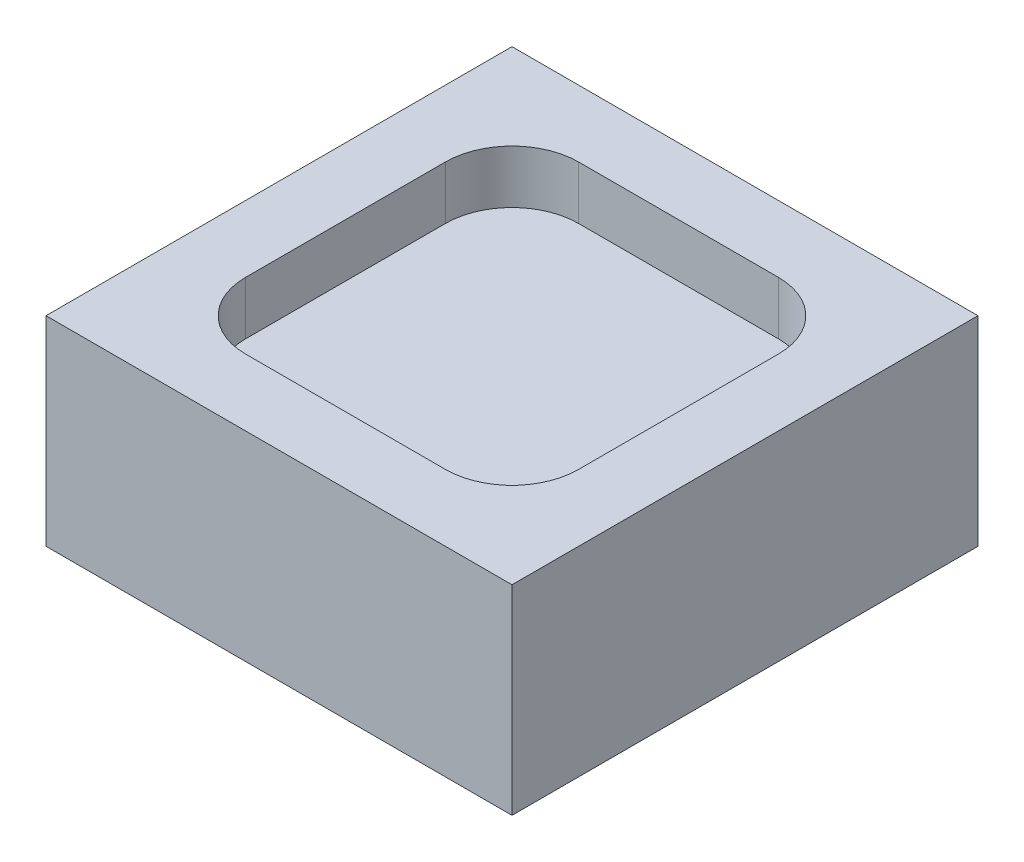
ISO-10303-21;
HEADER;
FILE_DESCRIPTION(('STEP AP214'),'2;1');
FILE_NAME('part.step','',(''),(''),'','','');
FILE_SCHEMA(('AUTOMOTIVE_DESIGN { 1 0 10303 214 1 1 1 1 }'));
ENDSEC;
DATA;
#1=APPLICATION_CONTEXT('core data for automotive mechanical design processes');
#2=APPLICATION_PROTOCOL_DEFINITION('international standard','automotive_design',2000,#1);
#3=PRODUCT_CONTEXT('',#1,'mechanical');
#4=PRODUCT('Part','Part','',(#3));
#5=PRODUCT_RELATED_PRODUCT_CATEGORY('part','',(#4));
#6=PRODUCT_DEFINITION_FORMATION('','',#4);
#7=PRODUCT_DEFINITION_CONTEXT('part definition',#1,'design');
#8=PRODUCT_DEFINITION('design','',#6,#7);
#9=PRODUCT_DEFINITION_SHAPE('','',#8);
#10=(LENGTH_UNIT() NAMED_UNIT(*) SI_UNIT(.MILLI.,.METRE.));
#11=(NAMED_UNIT(*) PLANE_ANGLE_UNIT() SI_UNIT($,.RADIAN.));
#12=(NAMED_UNIT(*) SI_UNIT($,.STERADIAN.) SOLID_ANGLE_UNIT());
#13=UNCERTAINTY_MEASURE_WITH_UNIT(LENGTH_MEASURE(1.E-05),#10,'distance_accuracy_value','');
#14=(GEOMETRIC_REPRESENTATION_CONTEXT(3) GLOBAL_UNCERTAINTY_ASSIGNED_CONTEXT((#13)) GLOBAL_UNIT_ASSIGNED_CONTEXT((#10,
#11,#12)) REPRESENTATION_CONTEXT('',''));
#15=CARTESIAN_POINT('',(0.,0.,0.));
#16=DIRECTION('',(0.,0.,1.));
#17=DIRECTION('',(1.,0.,0.));
#18=AXIS2_PLACEMENT_3D('',#15,#16,#17);
#19=CARTESIAN_POINT('',(3.5,3.,-3.5));
#20=DIRECTION('',(-1.,0.,0.));
#21=DIRECTION('',(0.,0.,1.));
#22=AXIS2_PLACEMENT_3D('',#19,#20,#21);
#23=PLANE('',#22);
#24=DIRECTION('',(0.,0.,-1.));
#25=VECTOR('',#24,1.);
#26=CARTESIAN_POINT('',(3.5,0.,-3.5));
#27=LINE('',#26,#25);
#28=CARTESIAN_POINT('',(3.5,0.,3.5));
#29=VERTEX_POINT('',#28);
#30=CARTESIAN_POINT('',(3.5,0.,-3.5));
#31=VERTEX_POINT('',#30);
#32=EDGE_CURVE('E198',#29,#31,#27,.T.);
#33=ORIENTED_EDGE('',*,*,#32,.T.);
#34=DIRECTION('',(0.,-1.,0.));
#35=VECTOR('',#34,1.);
#36=CARTESIAN_POINT('',(3.5,3.,-3.5));
#37=LINE('',#36,#35);
#38=CARTESIAN_POINT('',(3.5,3.,-3.5));
#39=VERTEX_POINT('',#38);
#40=EDGE_CURVE('E12',#39,#31,#37,.T.);
#41=ORIENTED_EDGE('',*,*,#40,.F.);
#42=DIRECTION('',(0.,0.,-1.));
#43=VECTOR('',#42,1.);
#44=CARTESIAN_POINT('',(3.5,3.,-3.5));
#45=LINE('',#44,#43);
#46=CARTESIAN_POINT('',(3.5,3.,3.5));
#47=VERTEX_POINT('',#46);
#48=EDGE_CURVE('E210',#47,#39,#45,.T.);
#49=ORIENTED_EDGE('',*,*,#48,.F.);
#50=DIRECTION('',(0.,-1.,0.));
#51=VECTOR('',#50,1.);
#52=CARTESIAN_POINT('',(3.5,3.,3.5));
#53=LINE('',#52,#51);
#54=EDGE_CURVE('E216',#47,#29,#53,.T.);
#55=ORIENTED_EDGE('',*,*,#54,.T.);
#56=EDGE_LOOP('',(#33,#41,#49,#55));
#57=FACE_BOUND('',#56,.T.);
#58=ADVANCED_FACE('F41',(#57),#23,.F.);
#59=CARTESIAN_POINT('',(-3.5,3.,-3.5));
#60=DIRECTION('',(0.,0.,1.));
#61=DIRECTION('',(1.,0.,0.));
#62=AXIS2_PLACEMENT_3D('',#59,#60,#61);
#63=PLANE('',#62);
#64=DIRECTION('',(-1.,0.,0.));
#65=VECTOR('',#64,1.);
#66=CARTESIAN_POINT('',(-3.5,0.,-3.5));
#67=LINE('',#66,#65);
#68=CARTESIAN_POINT('',(-3.5,0.,-3.5));
#69=VERTEX_POINT('',#68);
#70=EDGE_CURVE('E219',#31,#69,#67,.T.);
#71=ORIENTED_EDGE('',*,*,#70,.T.);
#72=DIRECTION('',(0.,-1.,0.));
#73=VECTOR('',#72,1.);
#74=CARTESIAN_POINT('',(-3.5,3.,-3.5));
#75=LINE('',#74,#73);
#76=CARTESIAN_POINT('',(-3.5,3.,-3.5));
#77=VERTEX_POINT('',#76);
#78=EDGE_CURVE('E48',#77,#69,#75,.T.);
#79=ORIENTED_EDGE('',*,*,#78,.F.);
#80=DIRECTION('',(-1.,0.,0.));
#81=VECTOR('',#80,1.);
#82=CARTESIAN_POINT('',(-3.5,3.,-3.5));
#83=LINE('',#82,#81);
#84=EDGE_CURVE('E92',#39,#77,#83,.T.);
#85=ORIENTED_EDGE('',*,*,#84,.F.);
#86=ORIENTED_EDGE('',*,*,#40,.T.);
#87=EDGE_LOOP('',(#71,#79,#85,#86));
#88=FACE_BOUND('',#87,.T.);
#89=ADVANCED_FACE('F248',(#88),#63,.F.);
#90=CARTESIAN_POINT('',(-3.5,3.,-3.5));
#91=DIRECTION('',(1.,0.,0.));
#92=DIRECTION('',(0.,0.,-1.));
#93=AXIS2_PLACEMENT_3D('',#90,#91,#92);
#94=PLANE('',#93);
#95=DIRECTION('',(0.,0.,1.));
#96=VECTOR('',#95,1.);
#97=CARTESIAN_POINT('',(-3.5,0.,-3.5));
#98=LINE('',#97,#96);
#99=CARTESIAN_POINT('',(-3.5,0.,3.5));
#100=VERTEX_POINT('',#99);
#101=EDGE_CURVE('E221',#69,#100,#98,.T.);
#102=ORIENTED_EDGE('',*,*,#101,.T.);
#103=DIRECTION('',(0.,-1.,0.));
#104=VECTOR('',#103,1.);
#105=CARTESIAN_POINT('',(-3.5,3.,3.5));
#106=LINE('',#105,#104);
#107=CARTESIAN_POINT('',(-3.5,3.,3.5));
#108=VERTEX_POINT('',#107);
#109=EDGE_CURVE('E225',#108,#100,#106,.T.);
#110=ORIENTED_EDGE('',*,*,#109,.F.);
#111=DIRECTION('',(0.,0.,1.));
#112=VECTOR('',#111,1.);
#113=CARTESIAN_POINT('',(-3.5,3.,-3.5));
#114=LINE('',#113,#112);
#115=EDGE_CURVE('E213',#77,#108,#114,.T.);
#116=ORIENTED_EDGE('',*,*,#115,.F.);
#117=ORIENTED_EDGE('',*,*,#78,.T.);
#118=EDGE_LOOP('',(#102,#110,#116,#117));
#119=FACE_BOUND('',#118,.T.);
#120=ADVANCED_FACE('F230',(#119),#94,.F.);
#121=CARTESIAN_POINT('',(-3.5,3.,3.5));
#122=DIRECTION('',(0.,0.,-1.));
#123=DIRECTION('',(-1.,0.,0.));
#124=AXIS2_PLACEMENT_3D('',#121,#122,#123);
#125=PLANE('',#124);
#126=DIRECTION('',(1.,0.,0.));
#127=VECTOR('',#126,1.);
#128=CARTESIAN_POINT('',(-3.5,0.,3.5));
#129=LINE('',#128,#127);
#130=EDGE_CURVE('E85',#100,#29,#129,.T.);
#131=ORIENTED_EDGE('',*,*,#130,.T.);
#132=ORIENTED_EDGE('',*,*,#54,.F.);
#133=DIRECTION('',(1.,0.,0.));
#134=VECTOR('',#133,1.);
#135=CARTESIAN_POINT('',(-3.5,3.,3.5));
#136=LINE('',#135,#134);
#137=EDGE_CURVE('E64',#108,#47,#136,.T.);
#138=ORIENTED_EDGE('',*,*,#137,.F.);
#139=ORIENTED_EDGE('',*,*,#109,.T.);
#140=EDGE_LOOP('',(#131,#132,#138,#139));
#141=FACE_BOUND('',#140,.T.);
#142=ADVANCED_FACE('F238',(#141),#125,.F.);
#143=CARTESIAN_POINT('',(0.,3.,0.));
#144=DIRECTION('',(0.,1.,0.));
#145=DIRECTION('',(0.,0.,1.));
#146=AXIS2_PLACEMENT_3D('',#143,#144,#145);
#147=PLANE('',#146);
#148=CARTESIAN_POINT('',(-1.5,3.,1.5));
#149=DIRECTION('',(0.,1.,0.));
#150=DIRECTION('',(0.,0.,1.));
#151=AXIS2_PLACEMENT_3D('',#148,#149,#150);
#152=CIRCLE('',#151,1.);
#153=CARTESIAN_POINT('',(-2.5,3.,1.5));
#154=VERTEX_POINT('',#153);
#155=CARTESIAN_POINT('',(-1.5,3.,2.5));
#156=VERTEX_POINT('',#155);
#157=EDGE_CURVE('E55',#154,#156,#152,.T.);
#158=ORIENTED_EDGE('',*,*,#157,.F.);
#159=DIRECTION('',(0.,0.,1.));
#160=VECTOR('',#159,1.);
#161=CARTESIAN_POINT('',(-2.5,3.,-1.5));
#162=LINE('',#161,#160);
#163=CARTESIAN_POINT('',(-2.5,3.,-1.5));
#164=VERTEX_POINT('',#163);
#165=EDGE_CURVE('E159',#164,#154,#162,.T.);
#166=ORIENTED_EDGE('',*,*,#165,.F.);
#167=CARTESIAN_POINT('',(-1.5,3.,-1.5));
#168=DIRECTION('',(0.,1.,0.));
#169=DIRECTION('',(0.,0.,1.));
#170=AXIS2_PLACEMENT_3D('',#167,#168,#169);
#171=CIRCLE('',#170,1.);
#172=CARTESIAN_POINT('',(-1.5,3.,-2.5));
#173=VERTEX_POINT('',#172);
#174=EDGE_CURVE('E162',#173,#164,#171,.T.);
#175=ORIENTED_EDGE('',*,*,#174,.F.);
#176=DIRECTION('',(-1.,0.,0.));
#177=VECTOR('',#176,1.);
#178=CARTESIAN_POINT('',(-1.5,3.,-2.5));
#179=LINE('',#178,#177);
#180=CARTESIAN_POINT('',(1.5,3.,-2.5));
#181=VERTEX_POINT('',#180);
#182=EDGE_CURVE('E191',#181,#173,#179,.T.);
#183=ORIENTED_EDGE('',*,*,#182,.F.);
#184=CARTESIAN_POINT('',(1.5,3.,-1.5));
#185=DIRECTION('',(0.,1.,0.));
#186=DIRECTION('',(0.,0.,-1.));
#187=AXIS2_PLACEMENT_3D('',#184,#185,#186);
#188=CIRCLE('',#187,1.);
#189=CARTESIAN_POINT('',(2.5,3.,-1.5));
#190=VERTEX_POINT('',#189);
#191=EDGE_CURVE('E188',#190,#181,#188,.T.);
#192=ORIENTED_EDGE('',*,*,#191,.F.);
#193=DIRECTION('',(0.,0.,-1.));
#194=VECTOR('',#193,1.);
#195=CARTESIAN_POINT('',(2.5,3.,-1.5));
#196=LINE('',#195,#194);
#197=CARTESIAN_POINT('',(2.5,3.,1.5));
#198=VERTEX_POINT('',#197);
#199=EDGE_CURVE('E185',#198,#190,#196,.T.);
#200=ORIENTED_EDGE('',*,*,#199,.F.);
#201=CARTESIAN_POINT('',(1.5,3.,1.5));
#202=DIRECTION('',(0.,1.,0.));
#203=DIRECTION('',(0.,0.,1.));
#204=AXIS2_PLACEMENT_3D('',#201,#202,#203);
#205=CIRCLE('',#204,1.);
#206=CARTESIAN_POINT('',(1.5,3.,2.5));
#207=VERTEX_POINT('',#206);
#208=EDGE_CURVE('E182',#207,#198,#205,.T.);
#209=ORIENTED_EDGE('',*,*,#208,.F.);
#210=DIRECTION('',(1.,0.,0.));
#211=VECTOR('',#210,1.);
#212=CARTESIAN_POINT('',(-1.5,3.,2.5));
#213=LINE('',#212,#211);
#214=EDGE_CURVE('E180',#156,#207,#213,.T.);
#215=ORIENTED_EDGE('',*,*,#214,.F.);
#216=EDGE_LOOP('',(#158,#166,#175,#183,#192,#200,#209,#215));
#217=FACE_BOUND('',#216,.T.);
#218=ORIENTED_EDGE('',*,*,#48,.T.);
#219=ORIENTED_EDGE('',*,*,#84,.T.);
#220=ORIENTED_EDGE('',*,*,#115,.T.);
#221=ORIENTED_EDGE('',*,*,#137,.T.);
#222=EDGE_LOOP('',(#218,#219,#220,#221));
#223=FACE_BOUND('',#222,.T.);
#224=ADVANCED_FACE('F240',(#217,#223),#147,.T.);
#225=CARTESIAN_POINT('',(0.,0.,0.));
#226=DIRECTION('',(0.,1.,0.));
#227=DIRECTION('',(0.,0.,1.));
#228=AXIS2_PLACEMENT_3D('',#225,#226,#227);
#229=PLANE('',#228);
#230=ORIENTED_EDGE('',*,*,#32,.F.);
#231=ORIENTED_EDGE('',*,*,#130,.F.);
#232=ORIENTED_EDGE('',*,*,#101,.F.);
#233=ORIENTED_EDGE('',*,*,#70,.F.);
#234=EDGE_LOOP('',(#230,#231,#232,#233));
#235=FACE_BOUND('',#234,.T.);
#236=ADVANCED_FACE('F234',(#235),#229,.F.);
#237=CARTESIAN_POINT('',(-1.5,2.2,1.5));
#238=DIRECTION('',(0.,1.,0.));
#239=DIRECTION('',(0.,0.,1.));
#240=AXIS2_PLACEMENT_3D('',#237,#238,#239);
#241=CYLINDRICAL_SURFACE('',#240,1.);
#242=ORIENTED_EDGE('',*,*,#157,.T.);
#243=DIRECTION('',(0.,1.,0.));
#244=VECTOR('',#243,1.);
#245=CARTESIAN_POINT('',(-1.5,2.2,2.5));
#246=LINE('',#245,#244);
#247=CARTESIAN_POINT('',(-1.5,2.2,2.5));
#248=VERTEX_POINT('',#247);
#249=EDGE_CURVE('E136',#248,#156,#246,.T.);
#250=ORIENTED_EDGE('',*,*,#249,.F.);
#251=CARTESIAN_POINT('',(-1.5,2.2,1.5));
#252=DIRECTION('',(0.,1.,0.));
#253=DIRECTION('',(0.,0.,1.));
#254=AXIS2_PLACEMENT_3D('',#251,#252,#253);
#255=CIRCLE('',#254,1.);
#256=CARTESIAN_POINT('',(-2.5,2.2,1.5));
#257=VERTEX_POINT('',#256);
#258=EDGE_CURVE('E140',#257,#248,#255,.T.);
#259=ORIENTED_EDGE('',*,*,#258,.F.);
#260=DIRECTION('',(0.,1.,0.));
#261=VECTOR('',#260,1.);
#262=CARTESIAN_POINT('',(-2.5,2.2,1.5));
#263=LINE('',#262,#261);
#264=EDGE_CURVE('E196',#257,#154,#263,.T.);
#265=ORIENTED_EDGE('',*,*,#264,.T.);
#266=EDGE_LOOP('',(#242,#250,#259,#265));
#267=FACE_BOUND('',#266,.T.);
#268=ADVANCED_FACE('F138',(#267),#241,.F.);
#269=CARTESIAN_POINT('',(-2.5,2.2,-1.5));
#270=DIRECTION('',(-1.,0.,0.));
#271=DIRECTION('',(0.,0.,1.));
#272=AXIS2_PLACEMENT_3D('',#269,#270,#271);
#273=PLANE('',#272);
#274=ORIENTED_EDGE('',*,*,#165,.T.);
#275=ORIENTED_EDGE('',*,*,#264,.F.);
#276=DIRECTION('',(0.,0.,1.));
#277=VECTOR('',#276,1.);
#278=CARTESIAN_POINT('',(-2.5,2.2,-1.5));
#279=LINE('',#278,#277);
#280=CARTESIAN_POINT('',(-2.5,2.2,-1.5));
#281=VERTEX_POINT('',#280);
#282=EDGE_CURVE('E146',#281,#257,#279,.T.);
#283=ORIENTED_EDGE('',*,*,#282,.F.);
#284=DIRECTION('',(0.,1.,0.));
#285=VECTOR('',#284,1.);
#286=CARTESIAN_POINT('',(-2.5,2.2,-1.5));
#287=LINE('',#286,#285);
#288=EDGE_CURVE('E199',#281,#164,#287,.T.);
#289=ORIENTED_EDGE('',*,*,#288,.T.);
#290=EDGE_LOOP('',(#274,#275,#283,#289));
#291=FACE_BOUND('',#290,.T.);
#292=ADVANCED_FACE('F287',(#291),#273,.F.);
#293=CARTESIAN_POINT('',(-1.5,2.2,-1.5));
#294=DIRECTION('',(0.,1.,0.));
#295=DIRECTION('',(0.,0.,1.));
#296=AXIS2_PLACEMENT_3D('',#293,#294,#295);
#297=CYLINDRICAL_SURFACE('',#296,1.);
#298=ORIENTED_EDGE('',*,*,#174,.T.);
#299=ORIENTED_EDGE('',*,*,#288,.F.);
#300=CARTESIAN_POINT('',(-1.5,2.2,-1.5));
#301=DIRECTION('',(0.,1.,0.));
#302=DIRECTION('',(0.,0.,1.));
#303=AXIS2_PLACEMENT_3D('',#300,#301,#302);
#304=CIRCLE('',#303,1.);
#305=CARTESIAN_POINT('',(-1.5,2.2,-2.5));
#306=VERTEX_POINT('',#305);
#307=EDGE_CURVE('E174',#306,#281,#304,.T.);
#308=ORIENTED_EDGE('',*,*,#307,.F.);
#309=DIRECTION('',(0.,1.,0.));
#310=VECTOR('',#309,1.);
#311=CARTESIAN_POINT('',(-1.5,2.2,-2.5));
#312=LINE('',#311,#310);
#313=EDGE_CURVE('E201',#306,#173,#312,.T.);
#314=ORIENTED_EDGE('',*,*,#313,.T.);
#315=EDGE_LOOP('',(#298,#299,#308,#314));
#316=FACE_BOUND('',#315,.T.);
#317=ADVANCED_FACE('F296',(#316),#297,.F.);
#318=CARTESIAN_POINT('',(-1.5,2.2,-2.5));
#319=DIRECTION('',(0.,0.,-1.));
#320=DIRECTION('',(-1.,0.,0.));
#321=AXIS2_PLACEMENT_3D('',#318,#319,#320);
#322=PLANE('',#321);
#323=ORIENTED_EDGE('',*,*,#182,.T.);
#324=ORIENTED_EDGE('',*,*,#313,.F.);
#325=DIRECTION('',(-1.,0.,0.));
#326=VECTOR('',#325,1.);
#327=CARTESIAN_POINT('',(-1.5,2.2,-2.5));
#328=LINE('',#327,#326);
#329=CARTESIAN_POINT('',(1.5,2.2,-2.5));
#330=VERTEX_POINT('',#329);
#331=EDGE_CURVE('E172',#330,#306,#328,.T.);
#332=ORIENTED_EDGE('',*,*,#331,.F.);
#333=DIRECTION('',(0.,1.,0.));
#334=VECTOR('',#333,1.);
#335=CARTESIAN_POINT('',(1.5,2.2,-2.5));
#336=LINE('',#335,#334);
#337=EDGE_CURVE('E203',#330,#181,#336,.T.);
#338=ORIENTED_EDGE('',*,*,#337,.T.);
#339=EDGE_LOOP('',(#323,#324,#332,#338));
#340=FACE_BOUND('',#339,.T.);
#341=ADVANCED_FACE('F306',(#340),#322,.F.);
#342=CARTESIAN_POINT('',(1.5,2.2,-1.5));
#343=DIRECTION('',(0.,1.,0.));
#344=DIRECTION('',(0.,0.,1.));
#345=AXIS2_PLACEMENT_3D('',#342,#343,#344);
#346=CYLINDRICAL_SURFACE('',#345,1.);
#347=ORIENTED_EDGE('',*,*,#191,.T.);
#348=ORIENTED_EDGE('',*,*,#337,.F.);
#349=CARTESIAN_POINT('',(1.5,2.2,-1.5));
#350=DIRECTION('',(0.,1.,0.));
#351=DIRECTION('',(0.,0.,-1.));
#352=AXIS2_PLACEMENT_3D('',#349,#350,#351);
#353=CIRCLE('',#352,1.);
#354=CARTESIAN_POINT('',(2.5,2.2,-1.5));
#355=VERTEX_POINT('',#354);
#356=EDGE_CURVE('E169',#355,#330,#353,.T.);
#357=ORIENTED_EDGE('',*,*,#356,.F.);
#358=DIRECTION('',(0.,1.,0.));
#359=VECTOR('',#358,1.);
#360=CARTESIAN_POINT('',(2.5,2.2,-1.5));
#361=LINE('',#360,#359);
#362=EDGE_CURVE('E205',#355,#190,#361,.T.);
#363=ORIENTED_EDGE('',*,*,#362,.T.);
#364=EDGE_LOOP('',(#347,#348,#357,#363));
#365=FACE_BOUND('',#364,.T.);
#366=ADVANCED_FACE('F316',(#365),#346,.F.);
#367=CARTESIAN_POINT('',(2.5,2.2,-1.5));
#368=DIRECTION('',(1.,0.,0.));
#369=DIRECTION('',(0.,0.,-1.));
#370=AXIS2_PLACEMENT_3D('',#367,#368,#369);
#371=PLANE('',#370);
#372=ORIENTED_EDGE('',*,*,#199,.T.);
#373=ORIENTED_EDGE('',*,*,#362,.F.);
#374=DIRECTION('',(0.,0.,-1.));
#375=VECTOR('',#374,1.);
#376=CARTESIAN_POINT('',(2.5,2.2,-1.5));
#377=LINE('',#376,#375);
#378=CARTESIAN_POINT('',(2.5,2.2,1.5));
#379=VERTEX_POINT('',#378);
#380=EDGE_CURVE('E166',#379,#355,#377,.T.);
#381=ORIENTED_EDGE('',*,*,#380,.F.);
#382=DIRECTION('',(0.,1.,0.));
#383=VECTOR('',#382,1.);
#384=CARTESIAN_POINT('',(2.5,2.2,1.5));
#385=LINE('',#384,#383);
#386=EDGE_CURVE('E207',#379,#198,#385,.T.);
#387=ORIENTED_EDGE('',*,*,#386,.T.);
#388=EDGE_LOOP('',(#372,#373,#381,#387));
#389=FACE_BOUND('',#388,.T.);
#390=ADVANCED_FACE('F326',(#389),#371,.F.);
#391=CARTESIAN_POINT('',(1.5,2.2,1.5));
#392=DIRECTION('',(0.,1.,0.));
#393=DIRECTION('',(0.,0.,1.));
#394=AXIS2_PLACEMENT_3D('',#391,#392,#393);
#395=CYLINDRICAL_SURFACE('',#394,1.);
#396=ORIENTED_EDGE('',*,*,#208,.T.);
#397=ORIENTED_EDGE('',*,*,#386,.F.);
#398=CARTESIAN_POINT('',(1.5,2.2,1.5));
#399=DIRECTION('',(0.,1.,0.));
#400=DIRECTION('',(0.,0.,1.));
#401=AXIS2_PLACEMENT_3D('',#398,#399,#400);
#402=CIRCLE('',#401,1.);
#403=CARTESIAN_POINT('',(1.5,2.2,2.5));
#404=VERTEX_POINT('',#403);
#405=EDGE_CURVE('E154',#404,#379,#402,.T.);
#406=ORIENTED_EDGE('',*,*,#405,.F.);
#407=DIRECTION('',(0.,1.,0.));
#408=VECTOR('',#407,1.);
#409=CARTESIAN_POINT('',(1.5,2.2,2.5));
#410=LINE('',#409,#408);
#411=EDGE_CURVE('E145',#404,#207,#410,.T.);
#412=ORIENTED_EDGE('',*,*,#411,.T.);
#413=EDGE_LOOP('',(#396,#397,#406,#412));
#414=FACE_BOUND('',#413,.T.);
#415=ADVANCED_FACE('F336',(#414),#395,.F.);
#416=CARTESIAN_POINT('',(-1.5,2.2,2.5));
#417=DIRECTION('',(0.,0.,1.));
#418=DIRECTION('',(1.,0.,0.));
#419=AXIS2_PLACEMENT_3D('',#416,#417,#418);
#420=PLANE('',#419);
#421=ORIENTED_EDGE('',*,*,#214,.T.);
#422=ORIENTED_EDGE('',*,*,#411,.F.);
#423=DIRECTION('',(1.,0.,0.));
#424=VECTOR('',#423,1.);
#425=CARTESIAN_POINT('',(-1.5,2.2,2.5));
#426=LINE('',#425,#424);
#427=EDGE_CURVE('E149',#248,#404,#426,.T.);
#428=ORIENTED_EDGE('',*,*,#427,.F.);
#429=ORIENTED_EDGE('',*,*,#249,.T.);
#430=EDGE_LOOP('',(#421,#422,#428,#429));
#431=FACE_BOUND('',#430,.T.);
#432=ADVANCED_FACE('F150',(#431),#420,.F.);
#433=CARTESIAN_POINT('',(-1.5,2.2,1.5));
#434=DIRECTION('',(0.,1.,0.));
#435=DIRECTION('',(0.,0.,1.));
#436=AXIS2_PLACEMENT_3D('',#433,#434,#435);
#437=PLANE('',#436);
#438=ORIENTED_EDGE('',*,*,#258,.T.);
#439=ORIENTED_EDGE('',*,*,#427,.T.);
#440=ORIENTED_EDGE('',*,*,#405,.T.);
#441=ORIENTED_EDGE('',*,*,#380,.T.);
#442=ORIENTED_EDGE('',*,*,#356,.T.);
#443=ORIENTED_EDGE('',*,*,#331,.T.);
#444=ORIENTED_EDGE('',*,*,#307,.T.);
#445=ORIENTED_EDGE('',*,*,#282,.T.);
#446=EDGE_LOOP('',(#438,#439,#440,#441,#442,#443,#444,#445));
#447=FACE_BOUND('',#446,.T.);
#448=ADVANCED_FACE('F156',(#447),#437,.T.);
#449=CLOSED_SHELL('',(#58,#89,#120,#142,#224,#236,#268,#292,#317,#341,#366,#390,#415,#432,#448));
#450=MANIFOLD_SOLID_BREP('B2',#449);
#451=ADVANCED_BREP_SHAPE_REPRESENTATION('',(#18,#450),#14);
#452=SHAPE_DEFINITION_REPRESENTATION(#9,#451);
ENDSEC;
END-ISO-10303-21;
